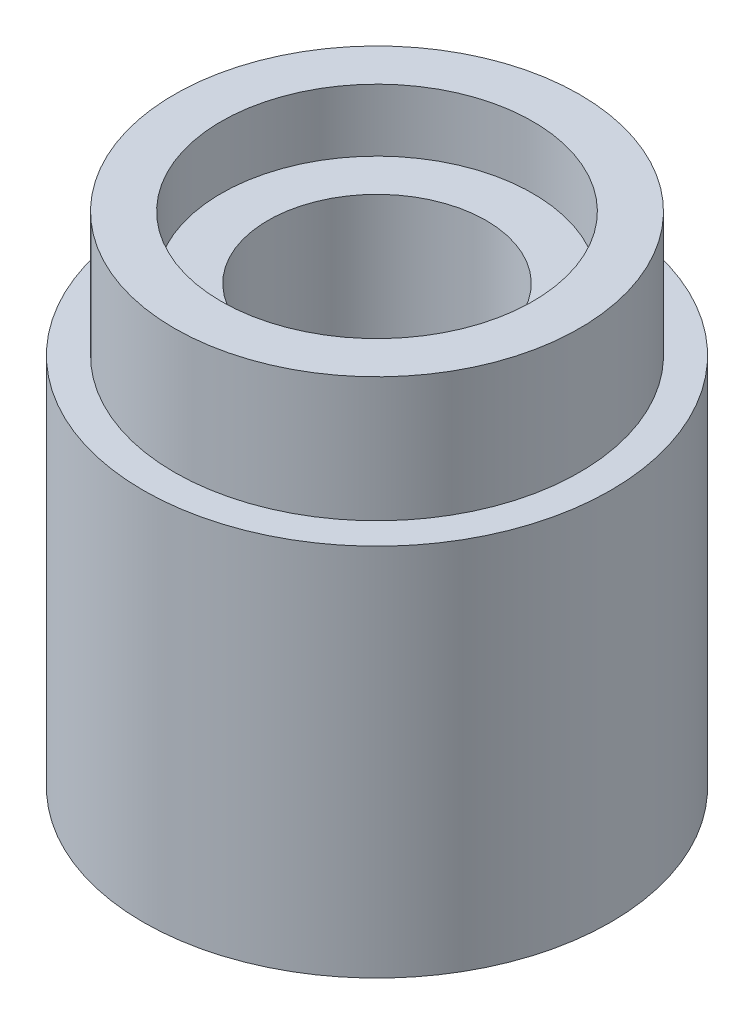
ISO-10303-21;
HEADER;
FILE_DESCRIPTION(('STEP AP214'),'2;1');
FILE_NAME('part.step','',(''),(''),'','','');
FILE_SCHEMA(('AUTOMOTIVE_DESIGN { 1 0 10303 214 1 1 1 1 }'));
ENDSEC;
DATA;
#1=APPLICATION_CONTEXT('core data for automotive mechanical design processes');
#2=APPLICATION_PROTOCOL_DEFINITION('international standard','automotive_design',2000,#1);
#3=PRODUCT_CONTEXT('',#1,'mechanical');
#4=PRODUCT('Part','Part','',(#3));
#5=PRODUCT_RELATED_PRODUCT_CATEGORY('part','',(#4));
#6=PRODUCT_DEFINITION_FORMATION('','',#4);
#7=PRODUCT_DEFINITION_CONTEXT('part definition',#1,'design');
#8=PRODUCT_DEFINITION('design','',#6,#7);
#9=PRODUCT_DEFINITION_SHAPE('','',#8);
#10=(LENGTH_UNIT() NAMED_UNIT(*) SI_UNIT(.MILLI.,.METRE.));
#11=(NAMED_UNIT(*) PLANE_ANGLE_UNIT() SI_UNIT($,.RADIAN.));
#12=(NAMED_UNIT(*) SI_UNIT($,.STERADIAN.) SOLID_ANGLE_UNIT());
#13=UNCERTAINTY_MEASURE_WITH_UNIT(LENGTH_MEASURE(1.E-05),#10,'distance_accuracy_value','');
#14=(GEOMETRIC_REPRESENTATION_CONTEXT(3) GLOBAL_UNCERTAINTY_ASSIGNED_CONTEXT((#13)) GLOBAL_UNIT_ASSIGNED_CONTEXT((#10,
#11,#12)) REPRESENTATION_CONTEXT('',''));
#15=CARTESIAN_POINT('',(0.,0.,0.));
#16=DIRECTION('',(0.,0.,1.));
#17=DIRECTION('',(1.,0.,0.));
#18=AXIS2_PLACEMENT_3D('',#15,#16,#17);
#19=CARTESIAN_POINT('',(0.,8.,0.));
#20=DIRECTION('',(0.,-1.,0.));
#21=DIRECTION('',(0.,0.,-1.));
#22=AXIS2_PLACEMENT_3D('',#19,#20,#21);
#23=CYLINDRICAL_SURFACE('',#22,3.75);
#24=CARTESIAN_POINT('',(0.,0.,0.));
#25=DIRECTION('',(0.,1.,0.));
#26=DIRECTION('',(0.,0.,1.));
#27=AXIS2_PLACEMENT_3D('',#24,#25,#26);
#28=CIRCLE('',#27,3.75);
#29=CARTESIAN_POINT('',(0.,0.,3.75));
#30=VERTEX_POINT('',#29);
#31=EDGE_CURVE('E10',#30,#30,#28,.T.);
#32=ORIENTED_EDGE('',*,*,#31,.T.);
#33=EDGE_LOOP('',(#32));
#34=FACE_BOUND('',#33,.T.);
#35=CARTESIAN_POINT('',(0.,6.,0.));
#36=DIRECTION('',(0.,1.,0.));
#37=DIRECTION('',(0.,0.,1.));
#38=AXIS2_PLACEMENT_3D('',#35,#36,#37);
#39=CIRCLE('',#38,3.75);
#40=CARTESIAN_POINT('',(0.,6.,3.75));
#41=VERTEX_POINT('',#40);
#42=EDGE_CURVE('E44',#41,#41,#39,.T.);
#43=ORIENTED_EDGE('',*,*,#42,.F.);
#44=EDGE_LOOP('',(#43));
#45=FACE_BOUND('',#44,.T.);
#46=ADVANCED_FACE('F36',(#34,#45),#23,.T.);
#47=CARTESIAN_POINT('',(0.,0.,0.));
#48=DIRECTION('',(0.,1.,0.));
#49=DIRECTION('',(0.,0.,1.));
#50=AXIS2_PLACEMENT_3D('',#47,#48,#49);
#51=PLANE('',#50);
#52=ORIENTED_EDGE('',*,*,#31,.F.);
#53=EDGE_LOOP('',(#52));
#54=FACE_BOUND('',#53,.T.);
#55=ADVANCED_FACE('F92',(#54),#51,.F.);
#56=CARTESIAN_POINT('',(0.,6.,0.));
#57=DIRECTION('',(0.,1.,0.));
#58=DIRECTION('',(0.,0.,1.));
#59=AXIS2_PLACEMENT_3D('',#56,#57,#58);
#60=PLANE('',#59);
#61=CARTESIAN_POINT('',(0.,6.,0.));
#62=DIRECTION('',(0.,1.,0.));
#63=DIRECTION('',(0.,0.,1.));
#64=AXIS2_PLACEMENT_3D('',#61,#62,#63);
#65=CIRCLE('',#64,3.25);
#66=CARTESIAN_POINT('',(0.,6.,3.25));
#67=VERTEX_POINT('',#66);
#68=EDGE_CURVE('E49',#67,#67,#65,.T.);
#69=ORIENTED_EDGE('',*,*,#68,.F.);
#70=EDGE_LOOP('',(#69));
#71=FACE_BOUND('',#70,.T.);
#72=ORIENTED_EDGE('',*,*,#42,.T.);
#73=EDGE_LOOP('',(#72));
#74=FACE_BOUND('',#73,.T.);
#75=ADVANCED_FACE('F96',(#71,#74),#60,.T.);
#76=CARTESIAN_POINT('',(0.,6.,0.));
#77=DIRECTION('',(0.,1.,0.));
#78=DIRECTION('',(0.,0.,1.));
#79=AXIS2_PLACEMENT_3D('',#76,#77,#78);
#80=CYLINDRICAL_SURFACE('',#79,3.25);
#81=ORIENTED_EDGE('',*,*,#68,.T.);
#82=EDGE_LOOP('',(#81));
#83=FACE_BOUND('',#82,.T.);
#84=CARTESIAN_POINT('',(0.,8.,0.));
#85=DIRECTION('',(0.,1.,0.));
#86=DIRECTION('',(0.,0.,1.));
#87=AXIS2_PLACEMENT_3D('',#84,#85,#86);
#88=CIRCLE('',#87,3.25);
#89=CARTESIAN_POINT('',(0.,8.,3.25));
#90=VERTEX_POINT('',#89);
#91=EDGE_CURVE('E52',#90,#90,#88,.T.);
#92=ORIENTED_EDGE('',*,*,#91,.F.);
#93=EDGE_LOOP('',(#92));
#94=FACE_BOUND('',#93,.T.);
#95=ADVANCED_FACE('F102',(#83,#94),#80,.T.);
#96=CARTESIAN_POINT('',(0.,8.,0.));
#97=DIRECTION('',(0.,1.,0.));
#98=DIRECTION('',(0.,0.,1.));
#99=AXIS2_PLACEMENT_3D('',#96,#97,#98);
#100=PLANE('',#99);
#101=CARTESIAN_POINT('',(0.,8.,0.));
#102=DIRECTION('',(0.,1.,0.));
#103=DIRECTION('',(0.,0.,1.));
#104=AXIS2_PLACEMENT_3D('',#101,#102,#103);
#105=CIRCLE('',#104,2.5);
#106=CARTESIAN_POINT('',(0.,8.,2.5));
#107=VERTEX_POINT('',#106);
#108=EDGE_CURVE('E63',#107,#107,#105,.T.);
#109=ORIENTED_EDGE('',*,*,#108,.F.);
#110=EDGE_LOOP('',(#109));
#111=FACE_BOUND('',#110,.T.);
#112=ORIENTED_EDGE('',*,*,#91,.T.);
#113=EDGE_LOOP('',(#112));
#114=FACE_BOUND('',#113,.T.);
#115=ADVANCED_FACE('F108',(#111,#114),#100,.T.);
#116=CARTESIAN_POINT('',(0.,7.,0.));
#117=DIRECTION('',(0.,1.,0.));
#118=DIRECTION('',(0.,0.,1.));
#119=AXIS2_PLACEMENT_3D('',#116,#117,#118);
#120=PLANE('',#119);
#121=CARTESIAN_POINT('',(0.,7.,0.));
#122=DIRECTION('',(0.,1.,0.));
#123=DIRECTION('',(0.,0.,1.));
#124=AXIS2_PLACEMENT_3D('',#121,#122,#123);
#125=CIRCLE('',#124,2.5);
#126=CARTESIAN_POINT('',(0.,7.,2.5));
#127=VERTEX_POINT('',#126);
#128=EDGE_CURVE('E67',#127,#127,#125,.T.);
#129=ORIENTED_EDGE('',*,*,#128,.T.);
#130=EDGE_LOOP('',(#129));
#131=FACE_BOUND('',#130,.T.);
#132=CARTESIAN_POINT('',(0.,7.,0.));
#133=DIRECTION('',(0.,1.,0.));
#134=DIRECTION('',(0.,0.,1.));
#135=AXIS2_PLACEMENT_3D('',#132,#133,#134);
#136=CIRCLE('',#135,1.75);
#137=CARTESIAN_POINT('',(0.,7.,1.75));
#138=VERTEX_POINT('',#137);
#139=EDGE_CURVE('E39',#138,#138,#136,.F.);
#140=ORIENTED_EDGE('',*,*,#139,.T.);
#141=EDGE_LOOP('',(#140));
#142=FACE_BOUND('',#141,.T.);
#143=ADVANCED_FACE('F76',(#131,#142),#120,.T.);
#144=CARTESIAN_POINT('',(0.,7.,0.));
#145=DIRECTION('',(0.,1.,0.));
#146=DIRECTION('',(0.,0.,1.));
#147=AXIS2_PLACEMENT_3D('',#144,#145,#146);
#148=CYLINDRICAL_SURFACE('',#147,2.5);
#149=ORIENTED_EDGE('',*,*,#128,.F.);
#150=EDGE_LOOP('',(#149));
#151=FACE_BOUND('',#150,.T.);
#152=ORIENTED_EDGE('',*,*,#108,.T.);
#153=EDGE_LOOP('',(#152));
#154=FACE_BOUND('',#153,.T.);
#155=ADVANCED_FACE('F86',(#151,#154),#148,.F.);
#156=CARTESIAN_POINT('',(0.,0.5,0.));
#157=DIRECTION('',(0.,1.,0.));
#158=DIRECTION('',(0.,0.,1.));
#159=AXIS2_PLACEMENT_3D('',#156,#157,#158);
#160=PLANE('',#159);
#161=CARTESIAN_POINT('',(0.,0.5,0.));
#162=DIRECTION('',(0.,1.,0.));
#163=DIRECTION('',(0.,0.,1.));
#164=AXIS2_PLACEMENT_3D('',#161,#162,#163);
#165=CIRCLE('',#164,1.75);
#166=CARTESIAN_POINT('',(0.,0.5,1.75));
#167=VERTEX_POINT('',#166);
#168=EDGE_CURVE('E56',#167,#167,#165,.T.);
#169=ORIENTED_EDGE('',*,*,#168,.T.);
#170=EDGE_LOOP('',(#169));
#171=FACE_BOUND('',#170,.T.);
#172=ADVANCED_FACE('F80',(#171),#160,.T.);
#173=CARTESIAN_POINT('',(0.,0.5,0.));
#174=DIRECTION('',(0.,1.,0.));
#175=DIRECTION('',(0.,0.,1.));
#176=AXIS2_PLACEMENT_3D('',#173,#174,#175);
#177=CYLINDRICAL_SURFACE('',#176,1.75);
#178=ORIENTED_EDGE('',*,*,#168,.F.);
#179=EDGE_LOOP('',(#178));
#180=FACE_BOUND('',#179,.T.);
#181=ORIENTED_EDGE('',*,*,#139,.F.);
#182=EDGE_LOOP('',(#181));
#183=FACE_BOUND('',#182,.T.);
#184=ADVANCED_FACE('F78',(#180,#183),#177,.F.);
#185=CLOSED_SHELL('',(#46,#55,#75,#95,#115,#143,#155,#172,#184));
#186=MANIFOLD_SOLID_BREP('B2',#185);
#187=ADVANCED_BREP_SHAPE_REPRESENTATION('',(#18,#186),#14);
#188=SHAPE_DEFINITION_REPRESENTATION(#9,#187);
ENDSEC;
END-ISO-10303-21;
